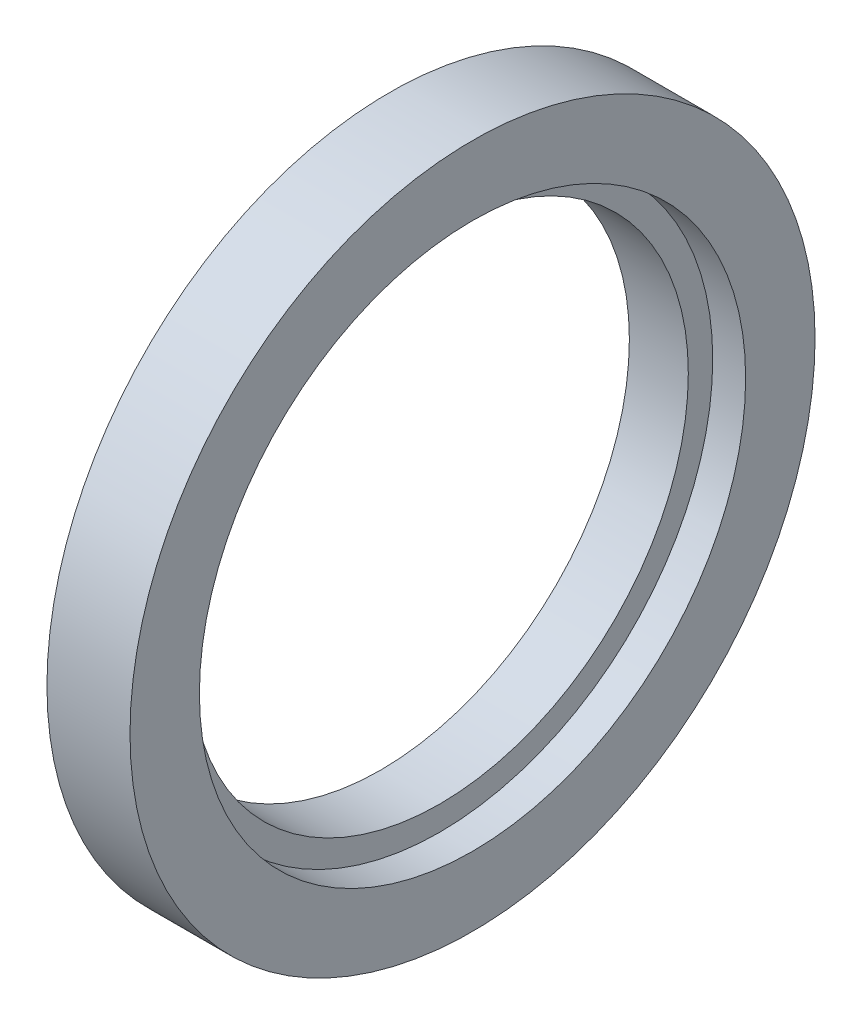
ISO-10303-21;
HEADER;
FILE_DESCRIPTION(('STEP AP214'),'2;1');
FILE_NAME('part.step','',(''),(''),'','','');
FILE_SCHEMA(('AUTOMOTIVE_DESIGN { 1 0 10303 214 1 1 1 1 }'));
ENDSEC;
DATA;
#1=APPLICATION_CONTEXT('core data for automotive mechanical design processes');
#2=APPLICATION_PROTOCOL_DEFINITION('international standard','automotive_design',2000,#1);
#3=PRODUCT_CONTEXT('',#1,'mechanical');
#4=PRODUCT('Part','Part','',(#3));
#5=PRODUCT_RELATED_PRODUCT_CATEGORY('part','',(#4));
#6=PRODUCT_DEFINITION_FORMATION('','',#4);
#7=PRODUCT_DEFINITION_CONTEXT('part definition',#1,'design');
#8=PRODUCT_DEFINITION('design','',#6,#7);
#9=PRODUCT_DEFINITION_SHAPE('','',#8);
#10=(LENGTH_UNIT() NAMED_UNIT(*) SI_UNIT(.MILLI.,.METRE.));
#11=(NAMED_UNIT(*) PLANE_ANGLE_UNIT() SI_UNIT($,.RADIAN.));
#12=(NAMED_UNIT(*) SI_UNIT($,.STERADIAN.) SOLID_ANGLE_UNIT());
#13=UNCERTAINTY_MEASURE_WITH_UNIT(LENGTH_MEASURE(1.E-05),#10,'distance_accuracy_value','');
#14=(GEOMETRIC_REPRESENTATION_CONTEXT(3) GLOBAL_UNCERTAINTY_ASSIGNED_CONTEXT((#13)) GLOBAL_UNIT_ASSIGNED_CONTEXT((#10,
#11,#12)) REPRESENTATION_CONTEXT('',''));
#15=CARTESIAN_POINT('',(0.,0.,0.));
#16=DIRECTION('',(0.,0.,1.));
#17=DIRECTION('',(1.,0.,0.));
#18=AXIS2_PLACEMENT_3D('',#15,#16,#17);
#19=CARTESIAN_POINT('',(2.0692999999999,0.,0.));
#20=DIRECTION('',(1.,0.,0.));
#21=DIRECTION('',(0.,0.,-1.));
#22=AXIS2_PLACEMENT_3D('',#19,#20,#21);
#23=CYLINDRICAL_SURFACE('',#22,17.4624999999999);
#24=CARTESIAN_POINT('',(4.13859999999983,0.,0.));
#25=DIRECTION('',(1.,0.,0.));
#26=DIRECTION('',(0.,0.,-1.));
#27=AXIS2_PLACEMENT_3D('',#24,#25,#26);
#28=CIRCLE('',#27,17.4624999999999);
#29=CARTESIAN_POINT('',(4.13859999999983,0.,-17.4624999999999));
#30=VERTEX_POINT('',#29);
#31=EDGE_CURVE('E17',#30,#30,#28,.F.);
#32=ORIENTED_EDGE('',*,*,#31,.F.);
#33=EDGE_LOOP('',(#32));
#34=FACE_BOUND('',#33,.T.);
#35=CARTESIAN_POINT('',(0.,0.,0.));
#36=DIRECTION('',(1.,0.,0.));
#37=DIRECTION('',(0.,0.,-1.));
#38=AXIS2_PLACEMENT_3D('',#35,#36,#37);
#39=CIRCLE('',#38,17.4624999999999);
#40=CARTESIAN_POINT('',(0.,0.,-17.4624999999999));
#41=VERTEX_POINT('',#40);
#42=EDGE_CURVE('E43',#41,#41,#39,.T.);
#43=ORIENTED_EDGE('',*,*,#42,.F.);
#44=EDGE_LOOP('',(#43));
#45=FACE_BOUND('',#44,.T.);
#46=ADVANCED_FACE('F14',(#34,#45),#23,.F.);
#47=CARTESIAN_POINT('',(4.13859999999983,18.3197499999999,0.));
#48=DIRECTION('',(1.,0.,0.));
#49=DIRECTION('',(0.,0.,-1.));
#50=AXIS2_PLACEMENT_3D('',#47,#48,#49);
#51=PLANE('',#50);
#52=ORIENTED_EDGE('',*,*,#31,.T.);
#53=EDGE_LOOP('',(#52));
#54=FACE_BOUND('',#53,.T.);
#55=CARTESIAN_POINT('',(4.13859999999983,0.,0.));
#56=DIRECTION('',(1.,0.,0.));
#57=DIRECTION('',(0.,0.,-1.));
#58=AXIS2_PLACEMENT_3D('',#55,#56,#57);
#59=CIRCLE('',#58,19.1769999999999);
#60=CARTESIAN_POINT('',(4.13859999999983,0.,-19.1769999999999));
#61=VERTEX_POINT('',#60);
#62=EDGE_CURVE('E41',#61,#61,#59,.T.);
#63=ORIENTED_EDGE('',*,*,#62,.T.);
#64=EDGE_LOOP('',(#63));
#65=FACE_BOUND('',#64,.T.);
#66=ADVANCED_FACE('F50',(#54,#65),#51,.T.);
#67=CARTESIAN_POINT('',(0.,19.2062500000005,0.));
#68=DIRECTION('',(-1.,0.,0.));
#69=DIRECTION('',(0.,0.,1.));
#70=AXIS2_PLACEMENT_3D('',#67,#68,#69);
#71=PLANE('',#70);
#72=ORIENTED_EDGE('',*,*,#42,.T.);
#73=EDGE_LOOP('',(#72));
#74=FACE_BOUND('',#73,.T.);
#75=CARTESIAN_POINT('',(0.,0.,0.));
#76=DIRECTION('',(1.,0.,0.));
#77=DIRECTION('',(0.,0.,-1.));
#78=AXIS2_PLACEMENT_3D('',#75,#76,#77);
#79=CIRCLE('',#78,20.950000000001);
#80=CARTESIAN_POINT('',(0.,0.,-20.950000000001));
#81=VERTEX_POINT('',#80);
#82=EDGE_CURVE('E38',#81,#81,#79,.F.);
#83=ORIENTED_EDGE('',*,*,#82,.T.);
#84=EDGE_LOOP('',(#83));
#85=FACE_BOUND('',#84,.T.);
#86=ADVANCED_FACE('F59',(#74,#85),#71,.T.);
#87=CARTESIAN_POINT('',(5.29429999999922,0.,0.));
#88=DIRECTION('',(1.,0.,0.));
#89=DIRECTION('',(0.,0.,-1.));
#90=AXIS2_PLACEMENT_3D('',#87,#88,#89);
#91=CYLINDRICAL_SURFACE('',#90,19.1769999999999);
#92=CARTESIAN_POINT('',(6.44999999999861,0.,0.));
#93=DIRECTION('',(1.,0.,0.));
#94=DIRECTION('',(0.,0.,-1.));
#95=AXIS2_PLACEMENT_3D('',#92,#93,#94);
#96=CIRCLE('',#95,19.1769999999999);
#97=CARTESIAN_POINT('',(6.44999999999861,0.,-19.1769999999999));
#98=VERTEX_POINT('',#97);
#99=EDGE_CURVE('E33',#98,#98,#96,.F.);
#100=ORIENTED_EDGE('',*,*,#99,.F.);
#101=EDGE_LOOP('',(#100));
#102=FACE_BOUND('',#101,.T.);
#103=ORIENTED_EDGE('',*,*,#62,.F.);
#104=EDGE_LOOP('',(#103));
#105=FACE_BOUND('',#104,.T.);
#106=ADVANCED_FACE('F78',(#102,#105),#91,.F.);
#107=CARTESIAN_POINT('',(-0.255000000000098,0.,0.));
#108=DIRECTION('',(1.,0.,0.));
#109=DIRECTION('',(0.,0.,-1.));
#110=AXIS2_PLACEMENT_3D('',#107,#108,#109);
#111=CYLINDRICAL_SURFACE('',#110,20.950000000001);
#112=ORIENTED_EDGE('',*,*,#82,.F.);
#113=EDGE_LOOP('',(#112));
#114=FACE_BOUND('',#113,.T.);
#115=CARTESIAN_POINT('',(-0.510000002164026,0.,0.));
#116=DIRECTION('',(1.,0.,0.));
#117=DIRECTION('',(0.,1.,0.));
#118=AXIS2_PLACEMENT_3D('',#115,#116,#117);
#119=CIRCLE('',#118,20.9500000007886);
#120=CARTESIAN_POINT('',(-0.510000002164026,20.9500000007886,0.));
#121=VERTEX_POINT('',#120);
#122=EDGE_CURVE('E26',#121,#121,#119,.T.);
#123=ORIENTED_EDGE('',*,*,#122,.F.);
#124=EDGE_LOOP('',(#123));
#125=FACE_BOUND('',#124,.T.);
#126=ADVANCED_FACE('F74',(#114,#125),#111,.F.);
#127=CARTESIAN_POINT('',(6.44999999999861,21.6135000000001,0.));
#128=DIRECTION('',(1.,0.,0.));
#129=DIRECTION('',(0.,0.,-1.));
#130=AXIS2_PLACEMENT_3D('',#127,#128,#129);
#131=PLANE('',#130);
#132=ORIENTED_EDGE('',*,*,#99,.T.);
#133=EDGE_LOOP('',(#132));
#134=FACE_BOUND('',#133,.T.);
#135=CARTESIAN_POINT('',(6.44999999999861,0.,0.));
#136=DIRECTION('',(1.,0.,0.));
#137=DIRECTION('',(0.,0.,-1.));
#138=AXIS2_PLACEMENT_3D('',#135,#136,#137);
#139=CIRCLE('',#138,24.0500000000003);
#140=CARTESIAN_POINT('',(6.44999999999861,0.,-24.0500000000003));
#141=VERTEX_POINT('',#140);
#142=EDGE_CURVE('E21',#141,#141,#139,.F.);
#143=ORIENTED_EDGE('',*,*,#142,.F.);
#144=EDGE_LOOP('',(#143));
#145=FACE_BOUND('',#144,.T.);
#146=ADVANCED_FACE('F67',(#134,#145),#131,.T.);
#147=CARTESIAN_POINT('',(0.618307728388946,0.,0.));
#148=DIRECTION('',(1.,0.,0.));
#149=DIRECTION('',(0.,0.,-1.));
#150=AXIS2_PLACEMENT_3D('',#147,#148,#149);
#151=CONICAL_SURFACE('',#150,24.0499999992128,1.22173047499991);
#152=ORIENTED_EDGE('',*,*,#122,.T.);
#153=EDGE_LOOP('',(#152));
#154=FACE_BOUND('',#153,.T.);
#155=CARTESIAN_POINT('',(0.618307726225102,0.,0.));
#156=DIRECTION('',(1.,0.,0.));
#157=DIRECTION('',(0.,0.,-1.));
#158=AXIS2_PLACEMENT_3D('',#155,#156,#157);
#159=CIRCLE('',#158,24.0500000000003);
#160=CARTESIAN_POINT('',(0.618307726225102,0.,-24.0500000000003));
#161=VERTEX_POINT('',#160);
#162=EDGE_CURVE('E10',#161,#161,#159,.T.);
#163=ORIENTED_EDGE('',*,*,#162,.F.);
#164=EDGE_LOOP('',(#163));
#165=FACE_BOUND('',#164,.T.);
#166=ADVANCED_FACE('F62',(#154,#165),#151,.T.);
#167=CARTESIAN_POINT('',(3.53415386311184,0.,0.));
#168=DIRECTION('',(1.,0.,0.));
#169=DIRECTION('',(0.,0.,-1.));
#170=AXIS2_PLACEMENT_3D('',#167,#168,#169);
#171=CYLINDRICAL_SURFACE('',#170,24.0500000000003);
#172=ORIENTED_EDGE('',*,*,#162,.T.);
#173=EDGE_LOOP('',(#172));
#174=FACE_BOUND('',#173,.T.);
#175=ORIENTED_EDGE('',*,*,#142,.T.);
#176=EDGE_LOOP('',(#175));
#177=FACE_BOUND('',#176,.T.);
#178=ADVANCED_FACE('F60',(#174,#177),#171,.T.);
#179=CLOSED_SHELL('',(#46,#66,#86,#106,#126,#146,#166,#178));
#180=MANIFOLD_SOLID_BREP('B1',#179);
#181=ADVANCED_BREP_SHAPE_REPRESENTATION('',(#18,#180),#14);
#182=SHAPE_DEFINITION_REPRESENTATION(#9,#181);
ENDSEC;
END-ISO-10303-21;
